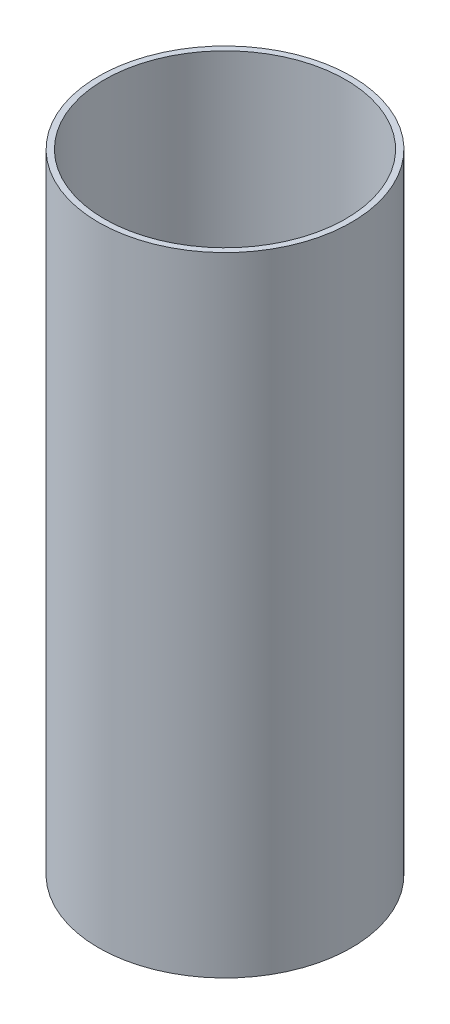
ISO-10303-21;
HEADER;
FILE_DESCRIPTION(('STEP AP214'),'2;1');
FILE_NAME('part.step','',(''),(''),'','','');
FILE_SCHEMA(('AUTOMOTIVE_DESIGN { 1 0 10303 214 1 1 1 1 }'));
ENDSEC;
DATA;
#1=APPLICATION_CONTEXT('core data for automotive mechanical design processes');
#2=APPLICATION_PROTOCOL_DEFINITION('international standard','automotive_design',2000,#1);
#3=PRODUCT_CONTEXT('',#1,'mechanical');
#4=PRODUCT('Part','Part','',(#3));
#5=PRODUCT_RELATED_PRODUCT_CATEGORY('part','',(#4));
#6=PRODUCT_DEFINITION_FORMATION('','',#4);
#7=PRODUCT_DEFINITION_CONTEXT('part definition',#1,'design');
#8=PRODUCT_DEFINITION('design','',#6,#7);
#9=PRODUCT_DEFINITION_SHAPE('','',#8);
#10=(LENGTH_UNIT() NAMED_UNIT(*) SI_UNIT(.MILLI.,.METRE.));
#11=(NAMED_UNIT(*) PLANE_ANGLE_UNIT() SI_UNIT($,.RADIAN.));
#12=(NAMED_UNIT(*) SI_UNIT($,.STERADIAN.) SOLID_ANGLE_UNIT());
#13=UNCERTAINTY_MEASURE_WITH_UNIT(LENGTH_MEASURE(1.E-05),#10,'distance_accuracy_value','');
#14=(GEOMETRIC_REPRESENTATION_CONTEXT(3) GLOBAL_UNCERTAINTY_ASSIGNED_CONTEXT((#13)) GLOBAL_UNIT_ASSIGNED_CONTEXT((#10,
#11,#12)) REPRESENTATION_CONTEXT('',''));
#15=CARTESIAN_POINT('',(0.,0.,0.));
#16=DIRECTION('',(0.,0.,1.));
#17=DIRECTION('',(1.,0.,0.));
#18=AXIS2_PLACEMENT_3D('',#15,#16,#17);
#19=CARTESIAN_POINT('',(0.,297.6,0.));
#20=DIRECTION('',(0.,1.,0.));
#21=DIRECTION('',(0.,0.,1.));
#22=AXIS2_PLACEMENT_3D('',#19,#20,#21);
#23=PLANE('',#22);
#24=CARTESIAN_POINT('',(0.,297.6,0.));
#25=DIRECTION('',(0.,1.,0.));
#26=DIRECTION('',(0.,0.,1.));
#27=AXIS2_PLACEMENT_3D('',#24,#25,#26);
#28=CIRCLE('',#27,59.94);
#29=CARTESIAN_POINT('',(0.,297.6,59.94));
#30=VERTEX_POINT('',#29);
#31=EDGE_CURVE('E10',#30,#30,#28,.T.);
#32=ORIENTED_EDGE('',*,*,#31,.T.);
#33=EDGE_LOOP('',(#32));
#34=FACE_BOUND('',#33,.T.);
#35=CARTESIAN_POINT('',(0.,297.6,0.));
#36=DIRECTION('',(0.,1.,0.));
#37=DIRECTION('',(0.,0.,1.));
#38=AXIS2_PLACEMENT_3D('',#35,#36,#37);
#39=CIRCLE('',#38,57.15);
#40=CARTESIAN_POINT('',(0.,297.6,57.15));
#41=VERTEX_POINT('',#40);
#42=EDGE_CURVE('E50',#41,#41,#39,.T.);
#43=ORIENTED_EDGE('',*,*,#42,.F.);
#44=EDGE_LOOP('',(#43));
#45=FACE_BOUND('',#44,.T.);
#46=ADVANCED_FACE('F37',(#34,#45),#23,.T.);
#47=CARTESIAN_POINT('',(0.,0.,0.));
#48=DIRECTION('',(0.,1.,0.));
#49=DIRECTION('',(0.,0.,1.));
#50=AXIS2_PLACEMENT_3D('',#47,#48,#49);
#51=PLANE('',#50);
#52=CARTESIAN_POINT('',(0.,0.,0.));
#53=DIRECTION('',(0.,1.,0.));
#54=DIRECTION('',(0.,0.,1.));
#55=AXIS2_PLACEMENT_3D('',#52,#53,#54);
#56=CIRCLE('',#55,59.94);
#57=CARTESIAN_POINT('',(0.,0.,59.94));
#58=VERTEX_POINT('',#57);
#59=EDGE_CURVE('E41',#58,#58,#56,.T.);
#60=ORIENTED_EDGE('',*,*,#59,.F.);
#61=EDGE_LOOP('',(#60));
#62=FACE_BOUND('',#61,.T.);
#63=CARTESIAN_POINT('',(0.,0.,0.));
#64=DIRECTION('',(0.,1.,0.));
#65=DIRECTION('',(0.,0.,1.));
#66=AXIS2_PLACEMENT_3D('',#63,#64,#65);
#67=CIRCLE('',#66,57.15);
#68=CARTESIAN_POINT('',(0.,0.,57.15));
#69=VERTEX_POINT('',#68);
#70=EDGE_CURVE('E52',#69,#69,#67,.T.);
#71=ORIENTED_EDGE('',*,*,#70,.T.);
#72=EDGE_LOOP('',(#71));
#73=FACE_BOUND('',#72,.T.);
#74=ADVANCED_FACE('F64',(#62,#73),#51,.F.);
#75=CARTESIAN_POINT('',(0.,297.6,0.));
#76=DIRECTION('',(0.,-1.,0.));
#77=DIRECTION('',(0.,0.,-1.));
#78=AXIS2_PLACEMENT_3D('',#75,#76,#77);
#79=CYLINDRICAL_SURFACE('',#78,59.94);
#80=ORIENTED_EDGE('',*,*,#31,.F.);
#81=EDGE_LOOP('',(#80));
#82=FACE_BOUND('',#81,.T.);
#83=ORIENTED_EDGE('',*,*,#59,.T.);
#84=EDGE_LOOP('',(#83));
#85=FACE_BOUND('',#84,.T.);
#86=ADVANCED_FACE('F39',(#82,#85),#79,.T.);
#87=CARTESIAN_POINT('',(0.,297.6,0.));
#88=DIRECTION('',(0.,-1.,0.));
#89=DIRECTION('',(0.,0.,-1.));
#90=AXIS2_PLACEMENT_3D('',#87,#88,#89);
#91=CYLINDRICAL_SURFACE('',#90,57.15);
#92=ORIENTED_EDGE('',*,*,#42,.T.);
#93=EDGE_LOOP('',(#92));
#94=FACE_BOUND('',#93,.T.);
#95=ORIENTED_EDGE('',*,*,#70,.F.);
#96=EDGE_LOOP('',(#95));
#97=FACE_BOUND('',#96,.T.);
#98=ADVANCED_FACE('F60',(#94,#97),#91,.F.);
#99=CLOSED_SHELL('',(#46,#74,#86,#98));
#100=MANIFOLD_SOLID_BREP('B2',#99);
#101=ADVANCED_BREP_SHAPE_REPRESENTATION('',(#18,#100),#14);
#102=SHAPE_DEFINITION_REPRESENTATION(#9,#101);
ENDSEC;
END-ISO-10303-21;
